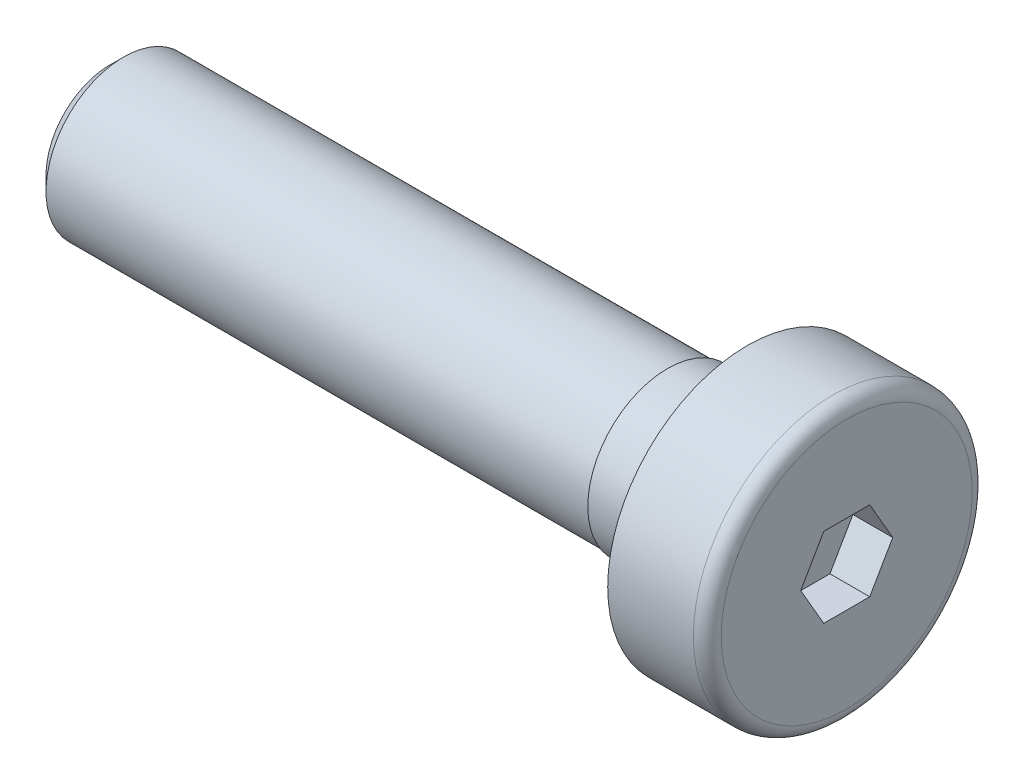
ISO-10303-21;
HEADER;
FILE_DESCRIPTION(('STEP AP214'),'2;1');
FILE_NAME('part.step','',(''),(''),'','','');
FILE_SCHEMA(('AUTOMOTIVE_DESIGN { 1 0 10303 214 1 1 1 1 }'));
ENDSEC;
DATA;
#1=APPLICATION_CONTEXT('core data for automotive mechanical design processes');
#2=APPLICATION_PROTOCOL_DEFINITION('international standard','automotive_design',2000,#1);
#3=PRODUCT_CONTEXT('',#1,'mechanical');
#4=PRODUCT('Part','Part','',(#3));
#5=PRODUCT_RELATED_PRODUCT_CATEGORY('part','',(#4));
#6=PRODUCT_DEFINITION_FORMATION('','',#4);
#7=PRODUCT_DEFINITION_CONTEXT('part definition',#1,'design');
#8=PRODUCT_DEFINITION('design','',#6,#7);
#9=PRODUCT_DEFINITION_SHAPE('','',#8);
#10=(LENGTH_UNIT() NAMED_UNIT(*) SI_UNIT(.MILLI.,.METRE.));
#11=(NAMED_UNIT(*) PLANE_ANGLE_UNIT() SI_UNIT($,.RADIAN.));
#12=(NAMED_UNIT(*) SI_UNIT($,.STERADIAN.) SOLID_ANGLE_UNIT());
#13=UNCERTAINTY_MEASURE_WITH_UNIT(LENGTH_MEASURE(1.E-05),#10,'distance_accuracy_value','');
#14=(GEOMETRIC_REPRESENTATION_CONTEXT(3) GLOBAL_UNCERTAINTY_ASSIGNED_CONTEXT((#13)) GLOBAL_UNIT_ASSIGNED_CONTEXT((#10,
#11,#12)) REPRESENTATION_CONTEXT('',''));
#15=CARTESIAN_POINT('',(0.,0.,0.));
#16=DIRECTION('',(0.,0.,1.));
#17=DIRECTION('',(1.,0.,0.));
#18=AXIS2_PLACEMENT_3D('',#15,#16,#17);
#19=CARTESIAN_POINT('',(-123.158940217391,0.,0.));
#20=DIRECTION('',(-1.,0.,0.));
#21=DIRECTION('',(0.,0.,1.));
#22=AXIS2_PLACEMENT_3D('',#19,#20,#21);
#23=CYLINDRICAL_SURFACE('',#22,2.);
#24=CARTESIAN_POINT('',(-2.5,0.,0.));
#25=DIRECTION('',(-1.,0.,0.));
#26=DIRECTION('',(0.,0.,1.));
#27=AXIS2_PLACEMENT_3D('',#24,#25,#26);
#28=CIRCLE('',#27,2.);
#29=CARTESIAN_POINT('',(-2.5,0.,2.));
#30=VERTEX_POINT('',#29);
#31=EDGE_CURVE('E143',#30,#30,#28,.T.);
#32=ORIENTED_EDGE('',*,*,#31,.T.);
#33=EDGE_LOOP('',(#32));
#34=FACE_BOUND('',#33,.T.);
#35=CARTESIAN_POINT('',(-4.5,0.,0.));
#36=DIRECTION('',(1.,0.,0.));
#37=DIRECTION('',(0.,0.,-1.));
#38=AXIS2_PLACEMENT_3D('',#35,#36,#37);
#39=CIRCLE('',#38,2.);
#40=CARTESIAN_POINT('',(-4.5,0.,-2.));
#41=VERTEX_POINT('',#40);
#42=EDGE_CURVE('E137',#41,#41,#39,.T.);
#43=ORIENTED_EDGE('',*,*,#42,.T.);
#44=EDGE_LOOP('',(#43));
#45=FACE_BOUND('',#44,.T.);
#46=ADVANCED_FACE('F36',(#34,#45),#23,.T.);
#47=CARTESIAN_POINT('',(0.,0.,0.));
#48=DIRECTION('',(-1.,0.,0.));
#49=DIRECTION('',(0.,0.,1.));
#50=AXIS2_PLACEMENT_3D('',#47,#48,#49);
#51=PLANE('',#50);
#52=DIRECTION('',(0.,0.866025403784438,0.5));
#53=VECTOR('',#52,1.);
#54=CARTESIAN_POINT('',(0.,0.,-1.15470053837925));
#55=LINE('',#54,#53);
#56=CARTESIAN_POINT('',(0.,0.,-1.15470053837925));
#57=VERTEX_POINT('',#56);
#58=CARTESIAN_POINT('',(0.,1.,-0.577350269189625));
#59=VERTEX_POINT('',#58);
#60=EDGE_CURVE('E109',#57,#59,#55,.T.);
#61=ORIENTED_EDGE('',*,*,#60,.F.);
#62=DIRECTION('',(0.,0.866025403784439,-0.5));
#63=VECTOR('',#62,1.);
#64=CARTESIAN_POINT('',(0.,-0.999999999999999,-0.577350269189627));
#65=LINE('',#64,#63);
#66=CARTESIAN_POINT('',(0.,-0.999999999999999,-0.577350269189627));
#67=VERTEX_POINT('',#66);
#68=EDGE_CURVE('E51',#67,#57,#65,.T.);
#69=ORIENTED_EDGE('',*,*,#68,.F.);
#70=DIRECTION('',(0.,0.,-1.));
#71=VECTOR('',#70,1.);
#72=CARTESIAN_POINT('',(0.,-1.,0.577350269189626));
#73=LINE('',#72,#71);
#74=CARTESIAN_POINT('',(0.,-1.,0.577350269189626));
#75=VERTEX_POINT('',#74);
#76=EDGE_CURVE('E125',#75,#67,#73,.T.);
#77=ORIENTED_EDGE('',*,*,#76,.F.);
#78=DIRECTION('',(0.,-0.866025403784439,-0.5));
#79=VECTOR('',#78,1.);
#80=CARTESIAN_POINT('',(0.,0.,1.15470053837925));
#81=LINE('',#80,#79);
#82=CARTESIAN_POINT('',(0.,0.,1.15470053837925));
#83=VERTEX_POINT('',#82);
#84=EDGE_CURVE('E119',#83,#75,#81,.T.);
#85=ORIENTED_EDGE('',*,*,#84,.F.);
#86=DIRECTION('',(0.,-0.866025403784438,0.5));
#87=VECTOR('',#86,1.);
#88=CARTESIAN_POINT('',(0.,1.,0.577350269189626));
#89=LINE('',#88,#87);
#90=CARTESIAN_POINT('',(0.,1.,0.577350269189626));
#91=VERTEX_POINT('',#90);
#92=EDGE_CURVE('E117',#91,#83,#89,.T.);
#93=ORIENTED_EDGE('',*,*,#92,.F.);
#94=DIRECTION('',(0.,0.,1.));
#95=VECTOR('',#94,1.);
#96=CARTESIAN_POINT('',(0.,1.,-0.577350269189625));
#97=LINE('',#96,#95);
#98=EDGE_CURVE('E102',#59,#91,#97,.T.);
#99=ORIENTED_EDGE('',*,*,#98,.F.);
#100=EDGE_LOOP('',(#61,#69,#77,#85,#93,#99));
#101=FACE_BOUND('',#100,.T.);
#102=CARTESIAN_POINT('',(0.,0.,0.));
#103=DIRECTION('',(-1.,0.,0.));
#104=DIRECTION('',(0.,0.,1.));
#105=AXIS2_PLACEMENT_3D('',#102,#103,#104);
#106=CIRCLE('',#105,3.15);
#107=CARTESIAN_POINT('',(0.,0.,3.15));
#108=VERTEX_POINT('',#107);
#109=EDGE_CURVE('E12',#108,#108,#106,.F.);
#110=ORIENTED_EDGE('',*,*,#109,.T.);
#111=EDGE_LOOP('',(#110));
#112=FACE_BOUND('',#111,.T.);
#113=ADVANCED_FACE('F113',(#101,#112),#51,.F.);
#114=CARTESIAN_POINT('',(-123.158940217391,0.,0.));
#115=DIRECTION('',(-1.,0.,0.));
#116=DIRECTION('',(0.,0.,1.));
#117=AXIS2_PLACEMENT_3D('',#114,#115,#116);
#118=CYLINDRICAL_SURFACE('',#117,3.5);
#119=CARTESIAN_POINT('',(-0.350000000000003,0.,0.));
#120=DIRECTION('',(-1.,0.,0.));
#121=DIRECTION('',(0.,0.,1.));
#122=AXIS2_PLACEMENT_3D('',#119,#120,#121);
#123=CIRCLE('',#122,3.5);
#124=CARTESIAN_POINT('',(-0.350000000000003,0.,3.5));
#125=VERTEX_POINT('',#124);
#126=EDGE_CURVE('E44',#125,#125,#123,.T.);
#127=ORIENTED_EDGE('',*,*,#126,.T.);
#128=EDGE_LOOP('',(#127));
#129=FACE_BOUND('',#128,.T.);
#130=CARTESIAN_POINT('',(-2.5,0.,0.));
#131=DIRECTION('',(-1.,0.,0.));
#132=DIRECTION('',(0.,0.,1.));
#133=AXIS2_PLACEMENT_3D('',#130,#131,#132);
#134=CIRCLE('',#133,3.5);
#135=CARTESIAN_POINT('',(-2.5,0.,3.5));
#136=VERTEX_POINT('',#135);
#137=EDGE_CURVE('E146',#136,#136,#134,.T.);
#138=ORIENTED_EDGE('',*,*,#137,.F.);
#139=EDGE_LOOP('',(#138));
#140=FACE_BOUND('',#139,.T.);
#141=ADVANCED_FACE('F157',(#129,#140),#118,.T.);
#142=CARTESIAN_POINT('',(-2.5,3.5,0.));
#143=DIRECTION('',(1.,0.,0.));
#144=DIRECTION('',(0.,0.,-1.));
#145=AXIS2_PLACEMENT_3D('',#142,#143,#144);
#146=PLANE('',#145);
#147=ORIENTED_EDGE('',*,*,#31,.F.);
#148=EDGE_LOOP('',(#147));
#149=FACE_BOUND('',#148,.T.);
#150=ORIENTED_EDGE('',*,*,#137,.T.);
#151=EDGE_LOOP('',(#150));
#152=FACE_BOUND('',#151,.T.);
#153=ADVANCED_FACE('F184',(#149,#152),#146,.F.);
#154=CARTESIAN_POINT('',(-4.5,0.,2.));
#155=DIRECTION('',(-1.,0.,0.));
#156=DIRECTION('',(0.,0.,1.));
#157=AXIS2_PLACEMENT_3D('',#154,#155,#156);
#158=PLANE('',#157);
#159=CARTESIAN_POINT('',(-4.5,0.,0.));
#160=DIRECTION('',(1.,0.,0.));
#161=DIRECTION('',(0.,0.,-1.));
#162=AXIS2_PLACEMENT_3D('',#159,#160,#161);
#163=CIRCLE('',#162,1.95);
#164=CARTESIAN_POINT('',(-4.5,0.,-1.95));
#165=VERTEX_POINT('',#164);
#166=EDGE_CURVE('E140',#165,#165,#163,.T.);
#167=ORIENTED_EDGE('',*,*,#166,.T.);
#168=EDGE_LOOP('',(#167));
#169=FACE_BOUND('',#168,.T.);
#170=ORIENTED_EDGE('',*,*,#42,.F.);
#171=EDGE_LOOP('',(#170));
#172=FACE_BOUND('',#171,.T.);
#173=ADVANCED_FACE('F187',(#169,#172),#158,.T.);
#174=CARTESIAN_POINT('',(0.,0.,0.));
#175=DIRECTION('',(1.,0.,0.));
#176=DIRECTION('',(0.,0.,-1.));
#177=AXIS2_PLACEMENT_3D('',#174,#175,#176);
#178=CYLINDRICAL_SURFACE('',#177,1.95);
#179=CARTESIAN_POINT('',(-18.15,0.,0.));
#180=DIRECTION('',(1.,0.,0.));
#181=DIRECTION('',(0.,0.,-1.));
#182=AXIS2_PLACEMENT_3D('',#179,#180,#181);
#183=CIRCLE('',#182,1.95);
#184=CARTESIAN_POINT('',(-18.15,0.,-1.95));
#185=VERTEX_POINT('',#184);
#186=EDGE_CURVE('E149',#185,#185,#183,.T.);
#187=ORIENTED_EDGE('',*,*,#186,.T.);
#188=EDGE_LOOP('',(#187));
#189=FACE_BOUND('',#188,.T.);
#190=ORIENTED_EDGE('',*,*,#166,.F.);
#191=EDGE_LOOP('',(#190));
#192=FACE_BOUND('',#191,.T.);
#193=ADVANCED_FACE('F205',(#189,#192),#178,.T.);
#194=CARTESIAN_POINT('',(-18.5,2.,0.));
#195=DIRECTION('',(1.,0.,0.));
#196=DIRECTION('',(0.,0.,-1.));
#197=AXIS2_PLACEMENT_3D('',#194,#195,#196);
#198=PLANE('',#197);
#199=CARTESIAN_POINT('',(-18.5,0.,0.));
#200=DIRECTION('',(1.,0.,0.));
#201=DIRECTION('',(0.,0.,-1.));
#202=AXIS2_PLACEMENT_3D('',#199,#200,#201);
#203=CIRCLE('',#202,1.6);
#204=CARTESIAN_POINT('',(-18.5,0.,-1.6));
#205=VERTEX_POINT('',#204);
#206=EDGE_CURVE('E152',#205,#205,#203,.F.);
#207=ORIENTED_EDGE('',*,*,#206,.T.);
#208=EDGE_LOOP('',(#207));
#209=FACE_BOUND('',#208,.T.);
#210=ADVANCED_FACE('F170',(#209),#198,.F.);
#211=CARTESIAN_POINT('',(-18.15,0.,0.));
#212=DIRECTION('',(1.,0.,0.));
#213=DIRECTION('',(0.,0.,-1.));
#214=AXIS2_PLACEMENT_3D('',#211,#212,#213);
#215=CONICAL_SURFACE('',#214,1.95,0.785398163397443);
#216=ORIENTED_EDGE('',*,*,#206,.F.);
#217=EDGE_LOOP('',(#216));
#218=FACE_BOUND('',#217,.T.);
#219=ORIENTED_EDGE('',*,*,#186,.F.);
#220=EDGE_LOOP('',(#219));
#221=FACE_BOUND('',#220,.T.);
#222=ADVANCED_FACE('F162',(#218,#221),#215,.T.);
#223=CARTESIAN_POINT('',(-0.350000000000003,0.,0.));
#224=DIRECTION('',(-1.,0.,0.));
#225=DIRECTION('',(0.,0.,1.));
#226=AXIS2_PLACEMENT_3D('',#223,#224,#225);
#227=TOROIDAL_SURFACE('',#226,3.15,0.35);
#228=ORIENTED_EDGE('',*,*,#109,.F.);
#229=EDGE_LOOP('',(#228));
#230=FACE_BOUND('',#229,.T.);
#231=ORIENTED_EDGE('',*,*,#126,.F.);
#232=EDGE_LOOP('',(#231));
#233=FACE_BOUND('',#232,.T.);
#234=ADVANCED_FACE('F38',(#230,#233),#227,.T.);
#235=CARTESIAN_POINT('',(-5.55505046330389,-0.999999999999999,-0.577350269189627));
#236=DIRECTION('',(0.,-0.5,-0.866025403784438));
#237=DIRECTION('',(0.,0.866025403784439,-0.5));
#238=AXIS2_PLACEMENT_3D('',#235,#236,#237);
#239=PLANE('',#238);
#240=DIRECTION('',(0.,-0.866025403784439,0.5));
#241=VECTOR('',#240,1.);
#242=CARTESIAN_POINT('',(-1.,-0.999999999999999,-0.577350269189627));
#243=LINE('',#242,#241);
#244=CARTESIAN_POINT('',(-1.,0.,-1.15470053837925));
#245=VERTEX_POINT('',#244);
#246=CARTESIAN_POINT('',(-1.,-0.999999999999999,-0.577350269189627));
#247=VERTEX_POINT('',#246);
#248=EDGE_CURVE('E70',#245,#247,#243,.T.);
#249=ORIENTED_EDGE('',*,*,#248,.T.);
#250=DIRECTION('',(1.,0.,0.));
#251=VECTOR('',#250,1.);
#252=CARTESIAN_POINT('',(-5.55505046330389,-0.999999999999999,-0.577350269189627));
#253=LINE('',#252,#251);
#254=EDGE_CURVE('E128',#247,#67,#253,.T.);
#255=ORIENTED_EDGE('',*,*,#254,.T.);
#256=ORIENTED_EDGE('',*,*,#68,.T.);
#257=DIRECTION('',(1.,0.,0.));
#258=VECTOR('',#257,1.);
#259=CARTESIAN_POINT('',(-5.55505046330389,0.,-1.15470053837925));
#260=LINE('',#259,#258);
#261=EDGE_CURVE('E106',#245,#57,#260,.T.);
#262=ORIENTED_EDGE('',*,*,#261,.F.);
#263=EDGE_LOOP('',(#249,#255,#256,#262));
#264=FACE_BOUND('',#263,.T.);
#265=ADVANCED_FACE('F161',(#264),#239,.F.);
#266=CARTESIAN_POINT('',(-5.55505046330389,-1.,0.577350269189626));
#267=DIRECTION('',(0.,-1.,0.));
#268=DIRECTION('',(0.,0.,-1.));
#269=AXIS2_PLACEMENT_3D('',#266,#267,#268);
#270=PLANE('',#269);
#271=DIRECTION('',(0.,0.,1.));
#272=VECTOR('',#271,1.);
#273=CARTESIAN_POINT('',(-1.,-1.,0.577350269189626));
#274=LINE('',#273,#272);
#275=CARTESIAN_POINT('',(-1.,-0.999999999999999,0.577350269189626));
#276=VERTEX_POINT('',#275);
#277=EDGE_CURVE('E293',#247,#276,#274,.T.);
#278=ORIENTED_EDGE('',*,*,#277,.T.);
#279=DIRECTION('',(1.,0.,0.));
#280=VECTOR('',#279,1.);
#281=CARTESIAN_POINT('',(-5.55505046330389,-1.,0.577350269189626));
#282=LINE('',#281,#280);
#283=EDGE_CURVE('E130',#276,#75,#282,.T.);
#284=ORIENTED_EDGE('',*,*,#283,.T.);
#285=ORIENTED_EDGE('',*,*,#76,.T.);
#286=ORIENTED_EDGE('',*,*,#254,.F.);
#287=EDGE_LOOP('',(#278,#284,#285,#286));
#288=FACE_BOUND('',#287,.T.);
#289=ADVANCED_FACE('F168',(#288),#270,.F.);
#290=CARTESIAN_POINT('',(-5.55505046330389,0.,1.15470053837925));
#291=DIRECTION('',(0.,-0.5,0.866025403784439));
#292=DIRECTION('',(0.,-0.866025403784439,-0.5));
#293=AXIS2_PLACEMENT_3D('',#290,#291,#292);
#294=PLANE('',#293);
#295=DIRECTION('',(0.,0.866025403784439,0.5));
#296=VECTOR('',#295,1.);
#297=CARTESIAN_POINT('',(-1.,0.,1.15470053837925));
#298=LINE('',#297,#296);
#299=CARTESIAN_POINT('',(-1.,0.,1.15470053837925));
#300=VERTEX_POINT('',#299);
#301=EDGE_CURVE('E296',#276,#300,#298,.T.);
#302=ORIENTED_EDGE('',*,*,#301,.T.);
#303=DIRECTION('',(1.,0.,0.));
#304=VECTOR('',#303,1.);
#305=CARTESIAN_POINT('',(-5.55505046330389,0.,1.15470053837925));
#306=LINE('',#305,#304);
#307=EDGE_CURVE('E132',#300,#83,#306,.T.);
#308=ORIENTED_EDGE('',*,*,#307,.T.);
#309=ORIENTED_EDGE('',*,*,#84,.T.);
#310=ORIENTED_EDGE('',*,*,#283,.F.);
#311=EDGE_LOOP('',(#302,#308,#309,#310));
#312=FACE_BOUND('',#311,.T.);
#313=ADVANCED_FACE('F243',(#312),#294,.F.);
#314=CARTESIAN_POINT('',(-5.55505046330389,1.,0.577350269189626));
#315=DIRECTION('',(0.,0.5,0.866025403784438));
#316=DIRECTION('',(0.,-0.866025403784439,0.5));
#317=AXIS2_PLACEMENT_3D('',#314,#315,#316);
#318=PLANE('',#317);
#319=DIRECTION('',(0.,0.866025403784439,-0.5));
#320=VECTOR('',#319,1.);
#321=CARTESIAN_POINT('',(-1.,1.,0.577350269189626));
#322=LINE('',#321,#320);
#323=CARTESIAN_POINT('',(-1.,1.,0.577350269189626));
#324=VERTEX_POINT('',#323);
#325=EDGE_CURVE('E60',#300,#324,#322,.T.);
#326=ORIENTED_EDGE('',*,*,#325,.T.);
#327=DIRECTION('',(1.,0.,0.));
#328=VECTOR('',#327,1.);
#329=CARTESIAN_POINT('',(-5.55505046330389,1.,0.577350269189626));
#330=LINE('',#329,#328);
#331=EDGE_CURVE('E105',#324,#91,#330,.T.);
#332=ORIENTED_EDGE('',*,*,#331,.T.);
#333=ORIENTED_EDGE('',*,*,#92,.T.);
#334=ORIENTED_EDGE('',*,*,#307,.F.);
#335=EDGE_LOOP('',(#326,#332,#333,#334));
#336=FACE_BOUND('',#335,.T.);
#337=ADVANCED_FACE('F252',(#336),#318,.F.);
#338=CARTESIAN_POINT('',(-5.55505046330389,1.,-0.577350269189625));
#339=DIRECTION('',(0.,1.,0.));
#340=DIRECTION('',(0.,0.,1.));
#341=AXIS2_PLACEMENT_3D('',#338,#339,#340);
#342=PLANE('',#341);
#343=DIRECTION('',(0.,0.,-1.));
#344=VECTOR('',#343,1.);
#345=CARTESIAN_POINT('',(-1.,1.,-0.577350269189625));
#346=LINE('',#345,#344);
#347=CARTESIAN_POINT('',(-1.,1.,-0.577350269189625));
#348=VERTEX_POINT('',#347);
#349=EDGE_CURVE('E104',#324,#348,#346,.T.);
#350=ORIENTED_EDGE('',*,*,#349,.T.);
#351=DIRECTION('',(1.,0.,0.));
#352=VECTOR('',#351,1.);
#353=CARTESIAN_POINT('',(-5.55505046330389,1.,-0.577350269189625));
#354=LINE('',#353,#352);
#355=EDGE_CURVE('E97',#348,#59,#354,.T.);
#356=ORIENTED_EDGE('',*,*,#355,.T.);
#357=ORIENTED_EDGE('',*,*,#98,.T.);
#358=ORIENTED_EDGE('',*,*,#331,.F.);
#359=EDGE_LOOP('',(#350,#356,#357,#358));
#360=FACE_BOUND('',#359,.T.);
#361=ADVANCED_FACE('F99',(#360),#342,.F.);
#362=CARTESIAN_POINT('',(-5.55505046330389,0.,-1.15470053837925));
#363=DIRECTION('',(0.,0.5,-0.866025403784438));
#364=DIRECTION('',(0.,0.866025403784439,0.5));
#365=AXIS2_PLACEMENT_3D('',#362,#363,#364);
#366=PLANE('',#365);
#367=DIRECTION('',(0.,-0.866025403784439,-0.5));
#368=VECTOR('',#367,1.);
#369=CARTESIAN_POINT('',(-1.,0.,-1.15470053837925));
#370=LINE('',#369,#368);
#371=EDGE_CURVE('E79',#348,#245,#370,.T.);
#372=ORIENTED_EDGE('',*,*,#371,.T.);
#373=ORIENTED_EDGE('',*,*,#261,.T.);
#374=ORIENTED_EDGE('',*,*,#60,.T.);
#375=ORIENTED_EDGE('',*,*,#355,.F.);
#376=EDGE_LOOP('',(#372,#373,#374,#375));
#377=FACE_BOUND('',#376,.T.);
#378=ADVANCED_FACE('F110',(#377),#366,.F.);
#379=CARTESIAN_POINT('',(-1.,3.5,0.));
#380=DIRECTION('',(1.,0.,0.));
#381=DIRECTION('',(0.,0.,-1.));
#382=AXIS2_PLACEMENT_3D('',#379,#380,#381);
#383=PLANE('',#382);
#384=ORIENTED_EDGE('',*,*,#248,.F.);
#385=ORIENTED_EDGE('',*,*,#371,.F.);
#386=ORIENTED_EDGE('',*,*,#349,.F.);
#387=ORIENTED_EDGE('',*,*,#325,.F.);
#388=ORIENTED_EDGE('',*,*,#301,.F.);
#389=ORIENTED_EDGE('',*,*,#277,.F.);
#390=EDGE_LOOP('',(#384,#385,#386,#387,#388,#389));
#391=FACE_BOUND('',#390,.T.);
#392=ADVANCED_FACE('F275',(#391),#383,.T.);
#393=CLOSED_SHELL('',(#46,#113,#141,#153,#173,#193,#210,#222,#234,#265,#289,#313,#337,#361,#378,#392));
#394=MANIFOLD_SOLID_BREP('B2',#393);
#395=ADVANCED_BREP_SHAPE_REPRESENTATION('',(#18,#394),#14);
#396=SHAPE_DEFINITION_REPRESENTATION(#9,#395);
ENDSEC;
END-ISO-10303-21;
